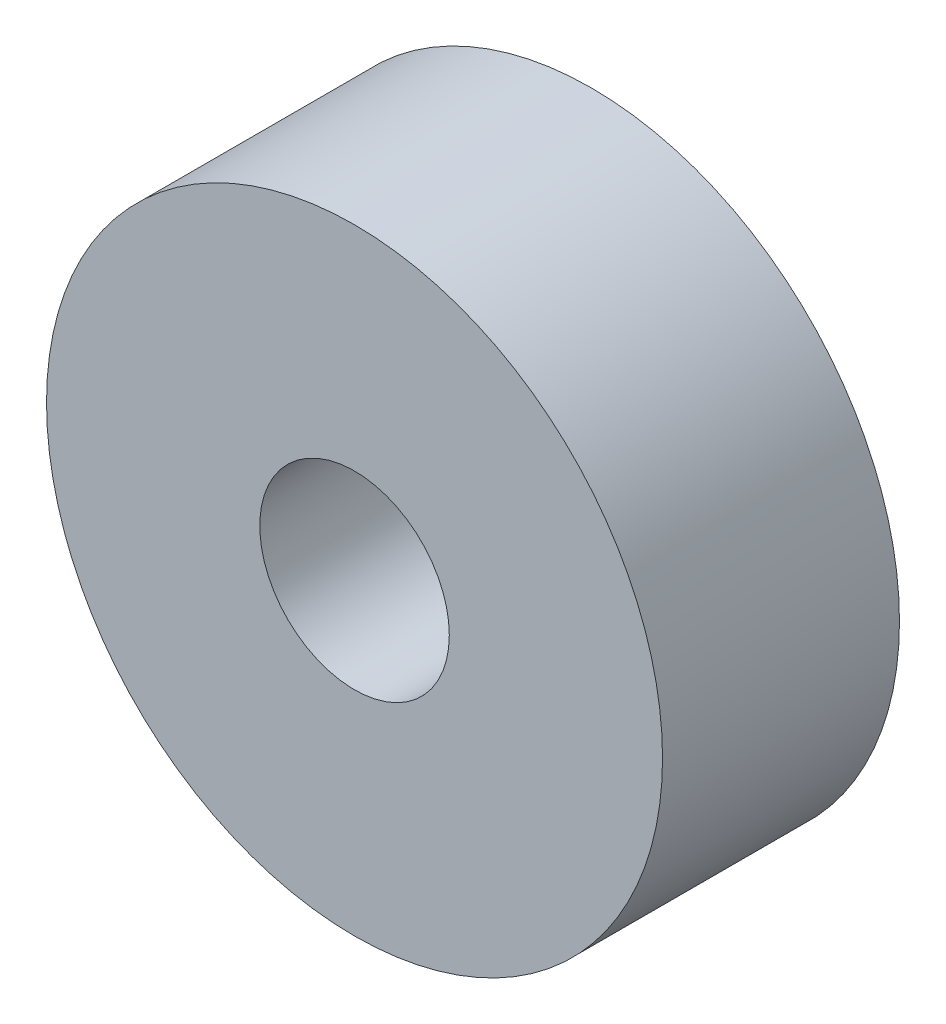
ISO-10303-21;
HEADER;
FILE_DESCRIPTION(('STEP AP214'),'2;1');
FILE_NAME('part.step','',(''),(''),'','','');
FILE_SCHEMA(('AUTOMOTIVE_DESIGN { 1 0 10303 214 1 1 1 1 }'));
ENDSEC;
DATA;
#1=APPLICATION_CONTEXT('core data for automotive mechanical design processes');
#2=APPLICATION_PROTOCOL_DEFINITION('international standard','automotive_design',2000,#1);
#3=PRODUCT_CONTEXT('',#1,'mechanical');
#4=PRODUCT('Part','Part','',(#3));
#5=PRODUCT_RELATED_PRODUCT_CATEGORY('part','',(#4));
#6=PRODUCT_DEFINITION_FORMATION('','',#4);
#7=PRODUCT_DEFINITION_CONTEXT('part definition',#1,'design');
#8=PRODUCT_DEFINITION('design','',#6,#7);
#9=PRODUCT_DEFINITION_SHAPE('','',#8);
#10=(LENGTH_UNIT() NAMED_UNIT(*) SI_UNIT(.MILLI.,.METRE.));
#11=(NAMED_UNIT(*) PLANE_ANGLE_UNIT() SI_UNIT($,.RADIAN.));
#12=(NAMED_UNIT(*) SI_UNIT($,.STERADIAN.) SOLID_ANGLE_UNIT());
#13=UNCERTAINTY_MEASURE_WITH_UNIT(LENGTH_MEASURE(1.E-05),#10,'distance_accuracy_value','');
#14=(GEOMETRIC_REPRESENTATION_CONTEXT(3) GLOBAL_UNCERTAINTY_ASSIGNED_CONTEXT((#13)) GLOBAL_UNIT_ASSIGNED_CONTEXT((#10,
#11,#12)) REPRESENTATION_CONTEXT('',''));
#15=CARTESIAN_POINT('',(0.,0.,0.));
#16=DIRECTION('',(0.,0.,1.));
#17=DIRECTION('',(1.,0.,0.));
#18=AXIS2_PLACEMENT_3D('',#15,#16,#17);
#19=CARTESIAN_POINT('',(0.,0.,2.5));
#20=DIRECTION('',(0.,0.,1.));
#21=DIRECTION('',(1.,0.,0.));
#22=AXIS2_PLACEMENT_3D('',#19,#20,#21);
#23=PLANE('',#22);
#24=CARTESIAN_POINT('',(0.,0.,2.5));
#25=DIRECTION('',(0.,0.,1.));
#26=DIRECTION('',(1.,0.,0.));
#27=AXIS2_PLACEMENT_3D('',#24,#25,#26);
#28=CIRCLE('',#27,6.5);
#29=CARTESIAN_POINT('',(6.5,0.,2.5));
#30=VERTEX_POINT('',#29);
#31=EDGE_CURVE('E10',#30,#30,#28,.T.);
#32=ORIENTED_EDGE('',*,*,#31,.T.);
#33=EDGE_LOOP('',(#32));
#34=FACE_BOUND('',#33,.T.);
#35=CARTESIAN_POINT('',(0.,0.,2.5));
#36=DIRECTION('',(0.,0.,1.));
#37=DIRECTION('',(1.,0.,0.));
#38=AXIS2_PLACEMENT_3D('',#35,#36,#37);
#39=CIRCLE('',#38,2.);
#40=CARTESIAN_POINT('',(2.,0.,2.5));
#41=VERTEX_POINT('',#40);
#42=EDGE_CURVE('E56',#41,#41,#39,.T.);
#43=ORIENTED_EDGE('',*,*,#42,.F.);
#44=EDGE_LOOP('',(#43));
#45=FACE_BOUND('',#44,.T.);
#46=ADVANCED_FACE('F43',(#34,#45),#23,.T.);
#47=CARTESIAN_POINT('',(0.,0.,-2.5));
#48=DIRECTION('',(0.,0.,1.));
#49=DIRECTION('',(1.,0.,0.));
#50=AXIS2_PLACEMENT_3D('',#47,#48,#49);
#51=PLANE('',#50);
#52=CARTESIAN_POINT('',(0.,0.,-2.5));
#53=DIRECTION('',(0.,0.,1.));
#54=DIRECTION('',(1.,0.,0.));
#55=AXIS2_PLACEMENT_3D('',#52,#53,#54);
#56=CIRCLE('',#55,6.5);
#57=CARTESIAN_POINT('',(6.5,0.,-2.5));
#58=VERTEX_POINT('',#57);
#59=EDGE_CURVE('E47',#58,#58,#56,.T.);
#60=ORIENTED_EDGE('',*,*,#59,.F.);
#61=EDGE_LOOP('',(#60));
#62=FACE_BOUND('',#61,.T.);
#63=CARTESIAN_POINT('',(0.,0.,-2.5));
#64=DIRECTION('',(0.,0.,1.));
#65=DIRECTION('',(1.,0.,0.));
#66=AXIS2_PLACEMENT_3D('',#63,#64,#65);
#67=CIRCLE('',#66,2.);
#68=CARTESIAN_POINT('',(2.,0.,-2.5));
#69=VERTEX_POINT('',#68);
#70=EDGE_CURVE('E58',#69,#69,#67,.T.);
#71=ORIENTED_EDGE('',*,*,#70,.T.);
#72=EDGE_LOOP('',(#71));
#73=FACE_BOUND('',#72,.T.);
#74=ADVANCED_FACE('F70',(#62,#73),#51,.F.);
#75=CARTESIAN_POINT('',(0.,0.,2.5));
#76=DIRECTION('',(0.,0.,-1.));
#77=DIRECTION('',(-1.,0.,0.));
#78=AXIS2_PLACEMENT_3D('',#75,#76,#77);
#79=CYLINDRICAL_SURFACE('',#78,6.5);
#80=ORIENTED_EDGE('',*,*,#31,.F.);
#81=EDGE_LOOP('',(#80));
#82=FACE_BOUND('',#81,.T.);
#83=ORIENTED_EDGE('',*,*,#59,.T.);
#84=EDGE_LOOP('',(#83));
#85=FACE_BOUND('',#84,.T.);
#86=ADVANCED_FACE('F45',(#82,#85),#79,.T.);
#87=CARTESIAN_POINT('',(0.,0.,2.5));
#88=DIRECTION('',(0.,0.,-1.));
#89=DIRECTION('',(-1.,0.,0.));
#90=AXIS2_PLACEMENT_3D('',#87,#88,#89);
#91=CYLINDRICAL_SURFACE('',#90,2.);
#92=ORIENTED_EDGE('',*,*,#42,.T.);
#93=EDGE_LOOP('',(#92));
#94=FACE_BOUND('',#93,.T.);
#95=ORIENTED_EDGE('',*,*,#70,.F.);
#96=EDGE_LOOP('',(#95));
#97=FACE_BOUND('',#96,.T.);
#98=ADVANCED_FACE('F66',(#94,#97),#91,.F.);
#99=CLOSED_SHELL('',(#46,#74,#86,#98));
#100=MANIFOLD_SOLID_BREP('B2',#99);
#101=ADVANCED_BREP_SHAPE_REPRESENTATION('',(#18,#100),#14);
#102=SHAPE_DEFINITION_REPRESENTATION(#9,#101);
ENDSEC;
END-ISO-10303-21;
